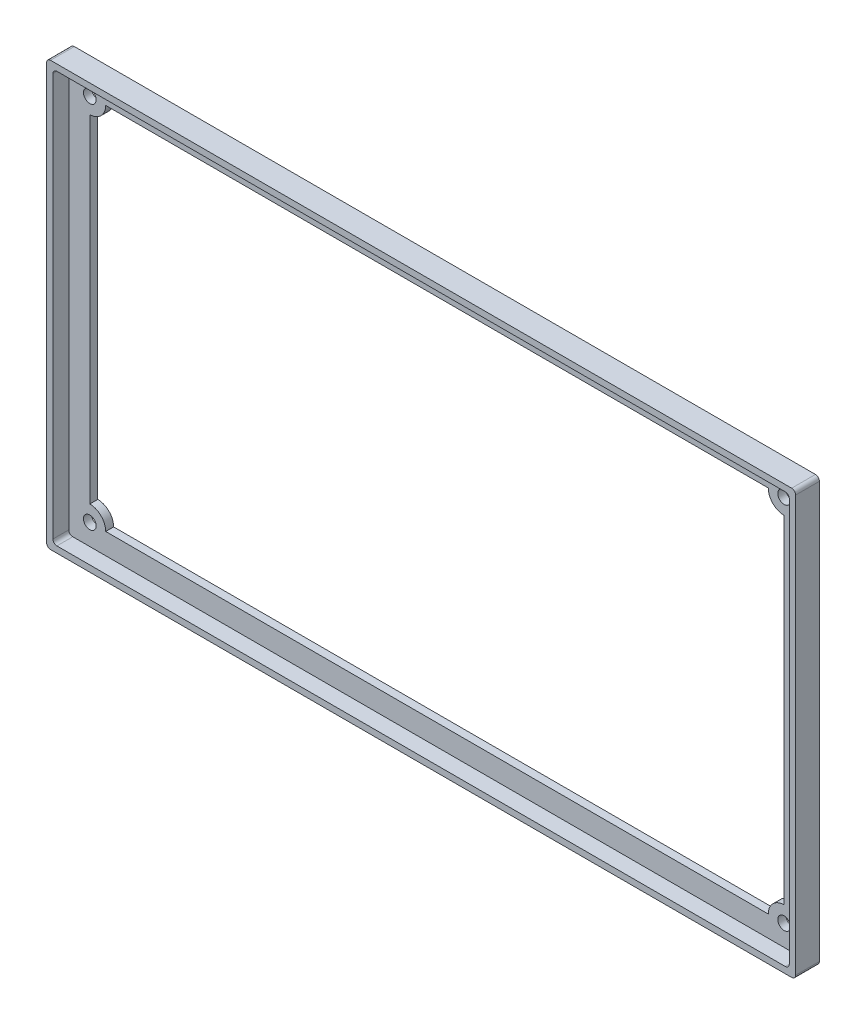
ISO-10303-21;
HEADER;
FILE_DESCRIPTION(('STEP AP214'),'2;1');
FILE_NAME('part.step','',(''),(''),'','','');
FILE_SCHEMA(('AUTOMOTIVE_DESIGN { 1 0 10303 214 1 1 1 1 }'));
ENDSEC;
DATA;
#1=APPLICATION_CONTEXT('core data for automotive mechanical design processes');
#2=APPLICATION_PROTOCOL_DEFINITION('international standard','automotive_design',2000,#1);
#3=PRODUCT_CONTEXT('',#1,'mechanical');
#4=PRODUCT('Part','Part','',(#3));
#5=PRODUCT_RELATED_PRODUCT_CATEGORY('part','',(#4));
#6=PRODUCT_DEFINITION_FORMATION('','',#4);
#7=PRODUCT_DEFINITION_CONTEXT('part definition',#1,'design');
#8=PRODUCT_DEFINITION('design','',#6,#7);
#9=PRODUCT_DEFINITION_SHAPE('','',#8);
#10=(LENGTH_UNIT() NAMED_UNIT(*) SI_UNIT(.MILLI.,.METRE.));
#11=(NAMED_UNIT(*) PLANE_ANGLE_UNIT() SI_UNIT($,.RADIAN.));
#12=(NAMED_UNIT(*) SI_UNIT($,.STERADIAN.) SOLID_ANGLE_UNIT());
#13=UNCERTAINTY_MEASURE_WITH_UNIT(LENGTH_MEASURE(1.E-05),#10,'distance_accuracy_value','');
#14=(GEOMETRIC_REPRESENTATION_CONTEXT(3) GLOBAL_UNCERTAINTY_ASSIGNED_CONTEXT((#13)) GLOBAL_UNIT_ASSIGNED_CONTEXT((#10,
#11,#12)) REPRESENTATION_CONTEXT('',''));
#15=CARTESIAN_POINT('',(0.,0.,0.));
#16=DIRECTION('',(0.,0.,1.));
#17=DIRECTION('',(1.,0.,0.));
#18=AXIS2_PLACEMENT_3D('',#15,#16,#17);
#19=CARTESIAN_POINT('',(0.,99.9,2.));
#20=DIRECTION('',(0.,1.,0.));
#21=DIRECTION('',(0.,0.,1.));
#22=AXIS2_PLACEMENT_3D('',#19,#20,#21);
#23=PLANE('',#22);
#24=DIRECTION('',(1.,0.,0.));
#25=VECTOR('',#24,1.);
#26=CARTESIAN_POINT('',(0.,99.9,0.));
#27=LINE('',#26,#25);
#28=CARTESIAN_POINT('',(10.9,99.9,0.));
#29=VERTEX_POINT('',#28);
#30=CARTESIAN_POINT('',(177.9,99.9,0.));
#31=VERTEX_POINT('',#30);
#32=EDGE_CURVE('E222',#29,#31,#27,.T.);
#33=ORIENTED_EDGE('',*,*,#32,.T.);
#34=DIRECTION('',(0.,0.,-1.));
#35=VECTOR('',#34,1.);
#36=CARTESIAN_POINT('',(177.9,99.9,2.));
#37=LINE('',#36,#35);
#38=CARTESIAN_POINT('',(177.9,99.9,2.));
#39=VERTEX_POINT('',#38);
#40=EDGE_CURVE('E203',#39,#31,#37,.T.);
#41=ORIENTED_EDGE('',*,*,#40,.F.);
#42=DIRECTION('',(1.,0.,0.));
#43=VECTOR('',#42,1.);
#44=CARTESIAN_POINT('',(0.,99.9,2.));
#45=LINE('',#44,#43);
#46=CARTESIAN_POINT('',(10.9,99.9,2.));
#47=VERTEX_POINT('',#46);
#48=EDGE_CURVE('E210',#47,#39,#45,.T.);
#49=ORIENTED_EDGE('',*,*,#48,.F.);
#50=DIRECTION('',(0.,0.,-1.));
#51=VECTOR('',#50,1.);
#52=CARTESIAN_POINT('',(10.9,99.9,2.));
#53=LINE('',#52,#51);
#54=EDGE_CURVE('E342',#47,#29,#53,.T.);
#55=ORIENTED_EDGE('',*,*,#54,.T.);
#56=EDGE_LOOP('',(#33,#41,#49,#55));
#57=FACE_BOUND('',#56,.T.);
#58=ADVANCED_FACE('F37',(#57),#23,.F.);
#59=CARTESIAN_POINT('',(181.9,99.9,2.));
#60=DIRECTION('',(0.,0.,-1.));
#61=DIRECTION('',(-1.,0.,0.));
#62=AXIS2_PLACEMENT_3D('',#59,#60,#61);
#63=CYLINDRICAL_SURFACE('',#62,3.99999999999999);
#64=CARTESIAN_POINT('',(181.9,99.9,0.));
#65=DIRECTION('',(0.,0.,1.));
#66=DIRECTION('',(1.,0.,0.));
#67=AXIS2_PLACEMENT_3D('',#64,#65,#66);
#68=CIRCLE('',#67,3.99999999999999);
#69=CARTESIAN_POINT('',(181.9,95.9,0.));
#70=VERTEX_POINT('',#69);
#71=EDGE_CURVE('E344',#31,#70,#68,.T.);
#72=ORIENTED_EDGE('',*,*,#71,.T.);
#73=DIRECTION('',(0.,0.,-1.));
#74=VECTOR('',#73,1.);
#75=CARTESIAN_POINT('',(181.9,95.9,2.));
#76=LINE('',#75,#74);
#77=CARTESIAN_POINT('',(181.9,95.9,2.));
#78=VERTEX_POINT('',#77);
#79=EDGE_CURVE('E206',#78,#70,#76,.T.);
#80=ORIENTED_EDGE('',*,*,#79,.F.);
#81=CARTESIAN_POINT('',(181.9,99.9,2.));
#82=DIRECTION('',(0.,0.,1.));
#83=DIRECTION('',(1.,0.,0.));
#84=AXIS2_PLACEMENT_3D('',#81,#82,#83);
#85=CIRCLE('',#84,3.99999999999999);
#86=EDGE_CURVE('E199',#39,#78,#85,.T.);
#87=ORIENTED_EDGE('',*,*,#86,.F.);
#88=ORIENTED_EDGE('',*,*,#40,.T.);
#89=EDGE_LOOP('',(#72,#80,#87,#88));
#90=FACE_BOUND('',#89,.T.);
#91=ADVANCED_FACE('F201',(#90),#63,.T.);
#92=CARTESIAN_POINT('',(181.9,0.,2.));
#93=DIRECTION('',(1.,0.,0.));
#94=DIRECTION('',(0.,1.,0.));
#95=AXIS2_PLACEMENT_3D('',#92,#93,#94);
#96=PLANE('',#95);
#97=DIRECTION('',(0.,-1.,0.));
#98=VECTOR('',#97,1.);
#99=CARTESIAN_POINT('',(181.9,0.,0.));
#100=LINE('',#99,#98);
#101=CARTESIAN_POINT('',(181.9,10.9,0.));
#102=VERTEX_POINT('',#101);
#103=EDGE_CURVE('E347',#70,#102,#100,.T.);
#104=ORIENTED_EDGE('',*,*,#103,.T.);
#105=DIRECTION('',(0.,0.,-1.));
#106=VECTOR('',#105,1.);
#107=CARTESIAN_POINT('',(181.9,10.9,2.));
#108=LINE('',#107,#106);
#109=CARTESIAN_POINT('',(181.9,10.9,2.));
#110=VERTEX_POINT('',#109);
#111=EDGE_CURVE('E227',#110,#102,#108,.T.);
#112=ORIENTED_EDGE('',*,*,#111,.F.);
#113=DIRECTION('',(0.,-1.,0.));
#114=VECTOR('',#113,1.);
#115=CARTESIAN_POINT('',(181.9,0.,2.));
#116=LINE('',#115,#114);
#117=EDGE_CURVE('E209',#78,#110,#116,.T.);
#118=ORIENTED_EDGE('',*,*,#117,.F.);
#119=ORIENTED_EDGE('',*,*,#79,.T.);
#120=EDGE_LOOP('',(#104,#112,#118,#119));
#121=FACE_BOUND('',#120,.T.);
#122=ADVANCED_FACE('F472',(#121),#96,.F.);
#123=CARTESIAN_POINT('',(181.9,6.9,2.));
#124=DIRECTION('',(0.,0.,-1.));
#125=DIRECTION('',(-1.,0.,0.));
#126=AXIS2_PLACEMENT_3D('',#123,#124,#125);
#127=CYLINDRICAL_SURFACE('',#126,3.99999999999999);
#128=CARTESIAN_POINT('',(181.9,6.9,0.));
#129=DIRECTION('',(0.,0.,1.));
#130=DIRECTION('',(1.,0.,0.));
#131=AXIS2_PLACEMENT_3D('',#128,#129,#130);
#132=CIRCLE('',#131,3.99999999999999);
#133=CARTESIAN_POINT('',(177.9,6.9,0.));
#134=VERTEX_POINT('',#133);
#135=EDGE_CURVE('E349',#102,#134,#132,.T.);
#136=ORIENTED_EDGE('',*,*,#135,.T.);
#137=DIRECTION('',(0.,0.,-1.));
#138=VECTOR('',#137,1.);
#139=CARTESIAN_POINT('',(177.9,6.9,2.));
#140=LINE('',#139,#138);
#141=CARTESIAN_POINT('',(177.9,6.9,2.));
#142=VERTEX_POINT('',#141);
#143=EDGE_CURVE('E380',#142,#134,#140,.T.);
#144=ORIENTED_EDGE('',*,*,#143,.F.);
#145=CARTESIAN_POINT('',(181.9,6.9,2.));
#146=DIRECTION('',(0.,0.,1.));
#147=DIRECTION('',(1.,0.,0.));
#148=AXIS2_PLACEMENT_3D('',#145,#146,#147);
#149=CIRCLE('',#148,3.99999999999999);
#150=EDGE_CURVE('E389',#110,#142,#149,.T.);
#151=ORIENTED_EDGE('',*,*,#150,.F.);
#152=ORIENTED_EDGE('',*,*,#111,.T.);
#153=EDGE_LOOP('',(#136,#144,#151,#152));
#154=FACE_BOUND('',#153,.T.);
#155=ADVANCED_FACE('F387',(#154),#127,.T.);
#156=CARTESIAN_POINT('',(0.,6.9,2.));
#157=DIRECTION('',(0.,-1.,0.));
#158=DIRECTION('',(0.,0.,-1.));
#159=AXIS2_PLACEMENT_3D('',#156,#157,#158);
#160=PLANE('',#159);
#161=DIRECTION('',(-1.,0.,0.));
#162=VECTOR('',#161,1.);
#163=CARTESIAN_POINT('',(0.,6.9,0.));
#164=LINE('',#163,#162);
#165=CARTESIAN_POINT('',(10.9,6.9,0.));
#166=VERTEX_POINT('',#165);
#167=EDGE_CURVE('E351',#134,#166,#164,.T.);
#168=ORIENTED_EDGE('',*,*,#167,.T.);
#169=DIRECTION('',(0.,0.,-1.));
#170=VECTOR('',#169,1.);
#171=CARTESIAN_POINT('',(10.9,6.9,2.));
#172=LINE('',#171,#170);
#173=CARTESIAN_POINT('',(10.9,6.9,2.));
#174=VERTEX_POINT('',#173);
#175=EDGE_CURVE('E377',#174,#166,#172,.T.);
#176=ORIENTED_EDGE('',*,*,#175,.F.);
#177=DIRECTION('',(-1.,0.,0.));
#178=VECTOR('',#177,1.);
#179=CARTESIAN_POINT('',(0.,6.9,2.));
#180=LINE('',#179,#178);
#181=EDGE_CURVE('E409',#142,#174,#180,.T.);
#182=ORIENTED_EDGE('',*,*,#181,.F.);
#183=ORIENTED_EDGE('',*,*,#143,.T.);
#184=EDGE_LOOP('',(#168,#176,#182,#183));
#185=FACE_BOUND('',#184,.T.);
#186=ADVANCED_FACE('F400',(#185),#160,.F.);
#187=CARTESIAN_POINT('',(6.89999999999998,6.9,2.));
#188=DIRECTION('',(0.,0.,-1.));
#189=DIRECTION('',(-1.,0.,0.));
#190=AXIS2_PLACEMENT_3D('',#187,#188,#189);
#191=CYLINDRICAL_SURFACE('',#190,4.);
#192=CARTESIAN_POINT('',(6.89999999999998,6.9,0.));
#193=DIRECTION('',(0.,0.,1.));
#194=DIRECTION('',(1.,0.,0.));
#195=AXIS2_PLACEMENT_3D('',#192,#193,#194);
#196=CIRCLE('',#195,4.);
#197=CARTESIAN_POINT('',(6.89999999999998,10.9,0.));
#198=VERTEX_POINT('',#197);
#199=EDGE_CURVE('E353',#166,#198,#196,.T.);
#200=ORIENTED_EDGE('',*,*,#199,.T.);
#201=DIRECTION('',(0.,0.,-1.));
#202=VECTOR('',#201,1.);
#203=CARTESIAN_POINT('',(6.89999999999998,10.9,2.));
#204=LINE('',#203,#202);
#205=CARTESIAN_POINT('',(6.89999999999998,10.9,2.));
#206=VERTEX_POINT('',#205);
#207=EDGE_CURVE('E374',#206,#198,#204,.T.);
#208=ORIENTED_EDGE('',*,*,#207,.F.);
#209=CARTESIAN_POINT('',(6.89999999999998,6.9,2.));
#210=DIRECTION('',(0.,0.,1.));
#211=DIRECTION('',(1.,0.,0.));
#212=AXIS2_PLACEMENT_3D('',#209,#210,#211);
#213=CIRCLE('',#212,4.);
#214=EDGE_CURVE('E406',#174,#206,#213,.T.);
#215=ORIENTED_EDGE('',*,*,#214,.F.);
#216=ORIENTED_EDGE('',*,*,#175,.T.);
#217=EDGE_LOOP('',(#200,#208,#215,#216));
#218=FACE_BOUND('',#217,.T.);
#219=ADVANCED_FACE('F404',(#218),#191,.T.);
#220=CARTESIAN_POINT('',(6.89999999999998,0.,2.));
#221=DIRECTION('',(-1.,0.,0.));
#222=DIRECTION('',(0.,0.,1.));
#223=AXIS2_PLACEMENT_3D('',#220,#221,#222);
#224=PLANE('',#223);
#225=DIRECTION('',(0.,1.,0.));
#226=VECTOR('',#225,1.);
#227=CARTESIAN_POINT('',(6.89999999999998,0.,0.));
#228=LINE('',#227,#226);
#229=CARTESIAN_POINT('',(6.89999999999998,95.9,0.));
#230=VERTEX_POINT('',#229);
#231=EDGE_CURVE('E355',#198,#230,#228,.T.);
#232=ORIENTED_EDGE('',*,*,#231,.T.);
#233=DIRECTION('',(0.,0.,-1.));
#234=VECTOR('',#233,1.);
#235=CARTESIAN_POINT('',(6.89999999999998,95.9,2.));
#236=LINE('',#235,#234);
#237=CARTESIAN_POINT('',(6.89999999999998,95.9,2.));
#238=VERTEX_POINT('',#237);
#239=EDGE_CURVE('E371',#238,#230,#236,.T.);
#240=ORIENTED_EDGE('',*,*,#239,.F.);
#241=DIRECTION('',(0.,1.,0.));
#242=VECTOR('',#241,1.);
#243=CARTESIAN_POINT('',(6.89999999999998,0.,2.));
#244=LINE('',#243,#242);
#245=EDGE_CURVE('E408',#206,#238,#244,.T.);
#246=ORIENTED_EDGE('',*,*,#245,.F.);
#247=ORIENTED_EDGE('',*,*,#207,.T.);
#248=EDGE_LOOP('',(#232,#240,#246,#247));
#249=FACE_BOUND('',#248,.T.);
#250=ADVANCED_FACE('F540',(#249),#224,.F.);
#251=CARTESIAN_POINT('',(181.9,6.9,2.));
#252=DIRECTION('',(0.,0.,-1.));
#253=DIRECTION('',(-1.,0.,0.));
#254=AXIS2_PLACEMENT_3D('',#251,#252,#253);
#255=CYLINDRICAL_SURFACE('',#254,1.59999999999999);
#256=CARTESIAN_POINT('',(181.9,6.9,2.));
#257=DIRECTION('',(0.,0.,1.));
#258=DIRECTION('',(1.,0.,0.));
#259=AXIS2_PLACEMENT_3D('',#256,#257,#258);
#260=CIRCLE('',#259,1.59999999999999);
#261=CARTESIAN_POINT('',(183.5,6.9,2.));
#262=VERTEX_POINT('',#261);
#263=EDGE_CURVE('E336',#262,#262,#260,.T.);
#264=ORIENTED_EDGE('',*,*,#263,.T.);
#265=EDGE_LOOP('',(#264));
#266=FACE_BOUND('',#265,.T.);
#267=CARTESIAN_POINT('',(181.9,6.9,0.));
#268=DIRECTION('',(0.,0.,1.));
#269=DIRECTION('',(1.,0.,0.));
#270=AXIS2_PLACEMENT_3D('',#267,#268,#269);
#271=CIRCLE('',#270,1.59999999999999);
#272=CARTESIAN_POINT('',(183.5,6.9,0.));
#273=VERTEX_POINT('',#272);
#274=EDGE_CURVE('E365',#273,#273,#271,.T.);
#275=ORIENTED_EDGE('',*,*,#274,.F.);
#276=EDGE_LOOP('',(#275));
#277=FACE_BOUND('',#276,.T.);
#278=ADVANCED_FACE('F536',(#266,#277),#255,.F.);
#279=CARTESIAN_POINT('',(6.89999999999998,6.9,2.));
#280=DIRECTION('',(0.,0.,-1.));
#281=DIRECTION('',(-1.,0.,0.));
#282=AXIS2_PLACEMENT_3D('',#279,#280,#281);
#283=CYLINDRICAL_SURFACE('',#282,1.6);
#284=CARTESIAN_POINT('',(6.89999999999998,6.9,2.));
#285=DIRECTION('',(0.,0.,1.));
#286=DIRECTION('',(1.,0.,0.));
#287=AXIS2_PLACEMENT_3D('',#284,#285,#286);
#288=CIRCLE('',#287,1.6);
#289=CARTESIAN_POINT('',(8.49999999999998,6.9,2.));
#290=VERTEX_POINT('',#289);
#291=EDGE_CURVE('E333',#290,#290,#288,.T.);
#292=ORIENTED_EDGE('',*,*,#291,.T.);
#293=EDGE_LOOP('',(#292));
#294=FACE_BOUND('',#293,.T.);
#295=CARTESIAN_POINT('',(6.89999999999998,6.9,0.));
#296=DIRECTION('',(0.,0.,1.));
#297=DIRECTION('',(1.,0.,0.));
#298=AXIS2_PLACEMENT_3D('',#295,#296,#297);
#299=CIRCLE('',#298,1.6);
#300=CARTESIAN_POINT('',(8.49999999999998,6.9,0.));
#301=VERTEX_POINT('',#300);
#302=EDGE_CURVE('E362',#301,#301,#299,.T.);
#303=ORIENTED_EDGE('',*,*,#302,.F.);
#304=EDGE_LOOP('',(#303));
#305=FACE_BOUND('',#304,.T.);
#306=ADVANCED_FACE('F539',(#294,#305),#283,.F.);
#307=CARTESIAN_POINT('',(6.89999999999998,99.9,2.));
#308=DIRECTION('',(0.,0.,-1.));
#309=DIRECTION('',(-1.,0.,0.));
#310=AXIS2_PLACEMENT_3D('',#307,#308,#309);
#311=CYLINDRICAL_SURFACE('',#310,1.6);
#312=CARTESIAN_POINT('',(6.89999999999998,99.9,2.));
#313=DIRECTION('',(0.,0.,1.));
#314=DIRECTION('',(1.,0.,0.));
#315=AXIS2_PLACEMENT_3D('',#312,#313,#314);
#316=CIRCLE('',#315,1.6);
#317=CARTESIAN_POINT('',(8.49999999999999,99.9,2.));
#318=VERTEX_POINT('',#317);
#319=EDGE_CURVE('E330',#318,#318,#316,.T.);
#320=ORIENTED_EDGE('',*,*,#319,.T.);
#321=EDGE_LOOP('',(#320));
#322=FACE_BOUND('',#321,.T.);
#323=CARTESIAN_POINT('',(6.89999999999998,99.9,0.));
#324=DIRECTION('',(0.,0.,1.));
#325=DIRECTION('',(1.,0.,0.));
#326=AXIS2_PLACEMENT_3D('',#323,#324,#325);
#327=CIRCLE('',#326,1.6);
#328=CARTESIAN_POINT('',(8.49999999999999,99.9,0.));
#329=VERTEX_POINT('',#328);
#330=EDGE_CURVE('E359',#329,#329,#327,.T.);
#331=ORIENTED_EDGE('',*,*,#330,.F.);
#332=EDGE_LOOP('',(#331));
#333=FACE_BOUND('',#332,.T.);
#334=ADVANCED_FACE('F544',(#322,#333),#311,.F.);
#335=CARTESIAN_POINT('',(6.89999999999998,99.9,2.));
#336=DIRECTION('',(0.,0.,-1.));
#337=DIRECTION('',(-1.,0.,0.));
#338=AXIS2_PLACEMENT_3D('',#335,#336,#337);
#339=CYLINDRICAL_SURFACE('',#338,4.);
#340=CARTESIAN_POINT('',(6.89999999999998,99.9,0.));
#341=DIRECTION('',(0.,0.,1.));
#342=DIRECTION('',(1.,0.,0.));
#343=AXIS2_PLACEMENT_3D('',#340,#341,#342);
#344=CIRCLE('',#343,4.);
#345=EDGE_CURVE('E357',#230,#29,#344,.T.);
#346=ORIENTED_EDGE('',*,*,#345,.T.);
#347=ORIENTED_EDGE('',*,*,#54,.F.);
#348=CARTESIAN_POINT('',(6.89999999999998,99.9,2.));
#349=DIRECTION('',(0.,0.,1.));
#350=DIRECTION('',(1.,0.,0.));
#351=AXIS2_PLACEMENT_3D('',#348,#349,#350);
#352=CIRCLE('',#351,4.);
#353=EDGE_CURVE('E215',#238,#47,#352,.T.);
#354=ORIENTED_EDGE('',*,*,#353,.F.);
#355=ORIENTED_EDGE('',*,*,#239,.T.);
#356=EDGE_LOOP('',(#346,#347,#354,#355));
#357=FACE_BOUND('',#356,.T.);
#358=ADVANCED_FACE('F534',(#357),#339,.T.);
#359=CARTESIAN_POINT('',(181.9,99.9,2.));
#360=DIRECTION('',(0.,0.,-1.));
#361=DIRECTION('',(-1.,0.,0.));
#362=AXIS2_PLACEMENT_3D('',#359,#360,#361);
#363=CYLINDRICAL_SURFACE('',#362,1.59999999999999);
#364=CARTESIAN_POINT('',(181.9,99.9,2.));
#365=DIRECTION('',(0.,0.,1.));
#366=DIRECTION('',(1.,0.,0.));
#367=AXIS2_PLACEMENT_3D('',#364,#365,#366);
#368=CIRCLE('',#367,1.59999999999999);
#369=CARTESIAN_POINT('',(183.5,99.9,2.));
#370=VERTEX_POINT('',#369);
#371=EDGE_CURVE('E339',#370,#370,#368,.T.);
#372=ORIENTED_EDGE('',*,*,#371,.T.);
#373=EDGE_LOOP('',(#372));
#374=FACE_BOUND('',#373,.T.);
#375=CARTESIAN_POINT('',(181.9,99.9,0.));
#376=DIRECTION('',(0.,0.,1.));
#377=DIRECTION('',(1.,0.,0.));
#378=AXIS2_PLACEMENT_3D('',#375,#376,#377);
#379=CIRCLE('',#378,1.59999999999999);
#380=CARTESIAN_POINT('',(183.5,99.9,0.));
#381=VERTEX_POINT('',#380);
#382=EDGE_CURVE('E219',#381,#381,#379,.T.);
#383=ORIENTED_EDGE('',*,*,#382,.F.);
#384=EDGE_LOOP('',(#383));
#385=FACE_BOUND('',#384,.T.);
#386=ADVANCED_FACE('F528',(#374,#385),#363,.F.);
#387=CARTESIAN_POINT('',(0.,0.,2.));
#388=DIRECTION('',(0.,0.,1.));
#389=DIRECTION('',(1.,0.,0.));
#390=AXIS2_PLACEMENT_3D('',#387,#388,#389);
#391=PLANE('',#390);
#392=ORIENTED_EDGE('',*,*,#48,.T.);
#393=ORIENTED_EDGE('',*,*,#86,.T.);
#394=ORIENTED_EDGE('',*,*,#117,.T.);
#395=ORIENTED_EDGE('',*,*,#150,.T.);
#396=ORIENTED_EDGE('',*,*,#181,.T.);
#397=ORIENTED_EDGE('',*,*,#214,.T.);
#398=ORIENTED_EDGE('',*,*,#245,.T.);
#399=ORIENTED_EDGE('',*,*,#353,.T.);
#400=EDGE_LOOP('',(#392,#393,#394,#395,#396,#397,#398,#399));
#401=FACE_BOUND('',#400,.T.);
#402=DIRECTION('',(1.,0.,0.));
#403=VECTOR('',#402,1.);
#404=CARTESIAN_POINT('',(0.,105.2,2.));
#405=LINE('',#404,#403);
#406=CARTESIAN_POINT('',(2.59999999999997,105.2,2.));
#407=VERTEX_POINT('',#406);
#408=CARTESIAN_POINT('',(186.2,105.2,2.));
#409=VERTEX_POINT('',#408);
#410=EDGE_CURVE('E321',#407,#409,#405,.T.);
#411=ORIENTED_EDGE('',*,*,#410,.F.);
#412=CARTESIAN_POINT('',(2.59999999999997,104.2,2.));
#413=DIRECTION('',(0.,0.,1.));
#414=DIRECTION('',(1.,0.,0.));
#415=AXIS2_PLACEMENT_3D('',#412,#413,#414);
#416=CIRCLE('',#415,1.);
#417=CARTESIAN_POINT('',(1.59999999999997,104.2,2.));
#418=VERTEX_POINT('',#417);
#419=EDGE_CURVE('E52',#407,#418,#416,.T.);
#420=ORIENTED_EDGE('',*,*,#419,.T.);
#421=DIRECTION('',(0.,1.,0.));
#422=VECTOR('',#421,1.);
#423=CARTESIAN_POINT('',(1.6,0.,2.));
#424=LINE('',#423,#422);
#425=CARTESIAN_POINT('',(1.6,2.6,2.));
#426=VERTEX_POINT('',#425);
#427=EDGE_CURVE('E324',#426,#418,#424,.T.);
#428=ORIENTED_EDGE('',*,*,#427,.F.);
#429=CARTESIAN_POINT('',(2.6,2.6,2.));
#430=DIRECTION('',(0.,0.,1.));
#431=DIRECTION('',(1.,0.,0.));
#432=AXIS2_PLACEMENT_3D('',#429,#430,#431);
#433=CIRCLE('',#432,1.);
#434=CARTESIAN_POINT('',(2.6,1.6,2.));
#435=VERTEX_POINT('',#434);
#436=EDGE_CURVE('E60',#426,#435,#433,.T.);
#437=ORIENTED_EDGE('',*,*,#436,.T.);
#438=DIRECTION('',(1.,0.,0.));
#439=VECTOR('',#438,1.);
#440=CARTESIAN_POINT('',(0.,1.6,2.));
#441=LINE('',#440,#439);
#442=CARTESIAN_POINT('',(186.2,1.6,2.));
#443=VERTEX_POINT('',#442);
#444=EDGE_CURVE('E317',#435,#443,#441,.T.);
#445=ORIENTED_EDGE('',*,*,#444,.T.);
#446=CARTESIAN_POINT('',(186.2,2.6,2.));
#447=DIRECTION('',(0.,0.,1.));
#448=DIRECTION('',(1.,0.,0.));
#449=AXIS2_PLACEMENT_3D('',#446,#447,#448);
#450=CIRCLE('',#449,1.);
#451=CARTESIAN_POINT('',(187.2,2.6,2.));
#452=VERTEX_POINT('',#451);
#453=EDGE_CURVE('E271',#443,#452,#450,.T.);
#454=ORIENTED_EDGE('',*,*,#453,.T.);
#455=DIRECTION('',(0.,1.,0.));
#456=VECTOR('',#455,1.);
#457=CARTESIAN_POINT('',(187.2,0.,2.));
#458=LINE('',#457,#456);
#459=CARTESIAN_POINT('',(187.2,104.2,2.));
#460=VERTEX_POINT('',#459);
#461=EDGE_CURVE('E316',#452,#460,#458,.T.);
#462=ORIENTED_EDGE('',*,*,#461,.T.);
#463=CARTESIAN_POINT('',(186.2,104.2,2.));
#464=DIRECTION('',(0.,0.,1.));
#465=DIRECTION('',(1.,0.,0.));
#466=AXIS2_PLACEMENT_3D('',#463,#464,#465);
#467=CIRCLE('',#466,1.);
#468=EDGE_CURVE('E269',#460,#409,#467,.T.);
#469=ORIENTED_EDGE('',*,*,#468,.T.);
#470=EDGE_LOOP('',(#411,#420,#428,#437,#445,#454,#462,#469));
#471=FACE_BOUND('',#470,.T.);
#472=ORIENTED_EDGE('',*,*,#319,.F.);
#473=EDGE_LOOP('',(#472));
#474=FACE_BOUND('',#473,.T.);
#475=ORIENTED_EDGE('',*,*,#291,.F.);
#476=EDGE_LOOP('',(#475));
#477=FACE_BOUND('',#476,.T.);
#478=ORIENTED_EDGE('',*,*,#263,.F.);
#479=EDGE_LOOP('',(#478));
#480=FACE_BOUND('',#479,.T.);
#481=ORIENTED_EDGE('',*,*,#371,.F.);
#482=EDGE_LOOP('',(#481));
#483=FACE_BOUND('',#482,.T.);
#484=ADVANCED_FACE('F213',(#401,#471,#474,#477,#480,#483),#391,.T.);
#485=CARTESIAN_POINT('',(0.,0.,0.));
#486=DIRECTION('',(0.,0.,1.));
#487=DIRECTION('',(1.,0.,0.));
#488=AXIS2_PLACEMENT_3D('',#485,#486,#487);
#489=PLANE('',#488);
#490=ORIENTED_EDGE('',*,*,#32,.F.);
#491=ORIENTED_EDGE('',*,*,#345,.F.);
#492=ORIENTED_EDGE('',*,*,#231,.F.);
#493=ORIENTED_EDGE('',*,*,#199,.F.);
#494=ORIENTED_EDGE('',*,*,#167,.F.);
#495=ORIENTED_EDGE('',*,*,#135,.F.);
#496=ORIENTED_EDGE('',*,*,#103,.F.);
#497=ORIENTED_EDGE('',*,*,#71,.F.);
#498=EDGE_LOOP('',(#490,#491,#492,#493,#494,#495,#496,#497));
#499=FACE_BOUND('',#498,.T.);
#500=ORIENTED_EDGE('',*,*,#330,.T.);
#501=EDGE_LOOP('',(#500));
#502=FACE_BOUND('',#501,.T.);
#503=ORIENTED_EDGE('',*,*,#302,.T.);
#504=EDGE_LOOP('',(#503));
#505=FACE_BOUND('',#504,.T.);
#506=ORIENTED_EDGE('',*,*,#274,.T.);
#507=EDGE_LOOP('',(#506));
#508=FACE_BOUND('',#507,.T.);
#509=ORIENTED_EDGE('',*,*,#382,.T.);
#510=EDGE_LOOP('',(#509));
#511=FACE_BOUND('',#510,.T.);
#512=DIRECTION('',(1.,0.,0.));
#513=VECTOR('',#512,1.);
#514=CARTESIAN_POINT('',(0.,0.,0.));
#515=LINE('',#514,#513);
#516=CARTESIAN_POINT('',(1.,0.,0.));
#517=VERTEX_POINT('',#516);
#518=CARTESIAN_POINT('',(187.8,0.,0.));
#519=VERTEX_POINT('',#518);
#520=EDGE_CURVE('E425',#517,#519,#515,.T.);
#521=ORIENTED_EDGE('',*,*,#520,.F.);
#522=CARTESIAN_POINT('',(1.,1.,0.));
#523=DIRECTION('',(0.,0.,1.));
#524=DIRECTION('',(1.,0.,0.));
#525=AXIS2_PLACEMENT_3D('',#522,#523,#524);
#526=CIRCLE('',#525,1.);
#527=CARTESIAN_POINT('',(0.,1.,0.));
#528=VERTEX_POINT('',#527);
#529=EDGE_CURVE('E239',#517,#528,#526,.F.);
#530=ORIENTED_EDGE('',*,*,#529,.T.);
#531=DIRECTION('',(0.,1.,0.));
#532=VECTOR('',#531,1.);
#533=CARTESIAN_POINT('',(0.,0.,0.));
#534=LINE('',#533,#532);
#535=CARTESIAN_POINT('',(0.,105.8,0.));
#536=VERTEX_POINT('',#535);
#537=EDGE_CURVE('E416',#528,#536,#534,.T.);
#538=ORIENTED_EDGE('',*,*,#537,.T.);
#539=CARTESIAN_POINT('',(1.,105.8,0.));
#540=DIRECTION('',(0.,0.,1.));
#541=DIRECTION('',(1.,0.,0.));
#542=AXIS2_PLACEMENT_3D('',#539,#540,#541);
#543=CIRCLE('',#542,1.);
#544=CARTESIAN_POINT('',(1.,106.8,0.));
#545=VERTEX_POINT('',#544);
#546=EDGE_CURVE('E233',#536,#545,#543,.F.);
#547=ORIENTED_EDGE('',*,*,#546,.T.);
#548=DIRECTION('',(1.,0.,0.));
#549=VECTOR('',#548,1.);
#550=CARTESIAN_POINT('',(0.,106.8,0.));
#551=LINE('',#550,#549);
#552=CARTESIAN_POINT('',(187.8,106.8,0.));
#553=VERTEX_POINT('',#552);
#554=EDGE_CURVE('E419',#545,#553,#551,.T.);
#555=ORIENTED_EDGE('',*,*,#554,.T.);
#556=CARTESIAN_POINT('',(187.8,105.8,0.));
#557=DIRECTION('',(0.,0.,1.));
#558=DIRECTION('',(1.,0.,0.));
#559=AXIS2_PLACEMENT_3D('',#556,#557,#558);
#560=CIRCLE('',#559,1.);
#561=CARTESIAN_POINT('',(188.8,105.8,0.));
#562=VERTEX_POINT('',#561);
#563=EDGE_CURVE('E235',#553,#562,#560,.F.);
#564=ORIENTED_EDGE('',*,*,#563,.T.);
#565=DIRECTION('',(0.,1.,0.));
#566=VECTOR('',#565,1.);
#567=CARTESIAN_POINT('',(188.8,0.,0.));
#568=LINE('',#567,#566);
#569=CARTESIAN_POINT('',(188.8,1.,0.));
#570=VERTEX_POINT('',#569);
#571=EDGE_CURVE('E422',#570,#562,#568,.T.);
#572=ORIENTED_EDGE('',*,*,#571,.F.);
#573=CARTESIAN_POINT('',(187.8,1.,0.));
#574=DIRECTION('',(0.,0.,1.));
#575=DIRECTION('',(1.,0.,0.));
#576=AXIS2_PLACEMENT_3D('',#573,#574,#575);
#577=CIRCLE('',#576,1.);
#578=EDGE_CURVE('E237',#570,#519,#577,.F.);
#579=ORIENTED_EDGE('',*,*,#578,.T.);
#580=EDGE_LOOP('',(#521,#530,#538,#547,#555,#564,#572,#579));
#581=FACE_BOUND('',#580,.T.);
#582=ADVANCED_FACE('F394',(#499,#502,#505,#508,#511,#581),#489,.F.);
#583=CARTESIAN_POINT('',(0.,0.,6.));
#584=DIRECTION('',(0.,1.,0.));
#585=DIRECTION('',(0.,0.,1.));
#586=AXIS2_PLACEMENT_3D('',#583,#584,#585);
#587=PLANE('',#586);
#588=DIRECTION('',(1.,0.,0.));
#589=VECTOR('',#588,1.);
#590=CARTESIAN_POINT('',(0.,0.,6.));
#591=LINE('',#590,#589);
#592=CARTESIAN_POINT('',(1.,0.,6.));
#593=VERTEX_POINT('',#592);
#594=CARTESIAN_POINT('',(187.8,0.,6.));
#595=VERTEX_POINT('',#594);
#596=EDGE_CURVE('E436',#593,#595,#591,.T.);
#597=ORIENTED_EDGE('',*,*,#596,.F.);
#598=DIRECTION('',(0.,0.,-1.));
#599=VECTOR('',#598,1.);
#600=CARTESIAN_POINT('',(1.,0.,0.));
#601=LINE('',#600,#599);
#602=EDGE_CURVE('E225',#593,#517,#601,.T.);
#603=ORIENTED_EDGE('',*,*,#602,.T.);
#604=ORIENTED_EDGE('',*,*,#520,.T.);
#605=DIRECTION('',(0.,0.,-1.));
#606=VECTOR('',#605,1.);
#607=CARTESIAN_POINT('',(187.8,0.,6.));
#608=LINE('',#607,#606);
#609=EDGE_CURVE('E223',#519,#595,#608,.F.);
#610=ORIENTED_EDGE('',*,*,#609,.T.);
#611=EDGE_LOOP('',(#597,#603,#604,#610));
#612=FACE_BOUND('',#611,.T.);
#613=ADVANCED_FACE('F506',(#612),#587,.F.);
#614=CARTESIAN_POINT('',(188.8,0.,6.));
#615=DIRECTION('',(-1.,0.,0.));
#616=DIRECTION('',(0.,0.,1.));
#617=AXIS2_PLACEMENT_3D('',#614,#615,#616);
#618=PLANE('',#617);
#619=DIRECTION('',(0.,1.,0.));
#620=VECTOR('',#619,1.);
#621=CARTESIAN_POINT('',(188.8,0.,6.));
#622=LINE('',#621,#620);
#623=CARTESIAN_POINT('',(188.8,1.,6.));
#624=VERTEX_POINT('',#623);
#625=CARTESIAN_POINT('',(188.8,105.8,6.));
#626=VERTEX_POINT('',#625);
#627=EDGE_CURVE('E433',#624,#626,#622,.T.);
#628=ORIENTED_EDGE('',*,*,#627,.F.);
#629=DIRECTION('',(0.,0.,-1.));
#630=VECTOR('',#629,1.);
#631=CARTESIAN_POINT('',(188.8,1.,6.));
#632=LINE('',#631,#630);
#633=EDGE_CURVE('E256',#624,#570,#632,.T.);
#634=ORIENTED_EDGE('',*,*,#633,.T.);
#635=ORIENTED_EDGE('',*,*,#571,.T.);
#636=DIRECTION('',(0.,0.,-1.));
#637=VECTOR('',#636,1.);
#638=CARTESIAN_POINT('',(188.8,105.8,6.));
#639=LINE('',#638,#637);
#640=EDGE_CURVE('E254',#562,#626,#639,.F.);
#641=ORIENTED_EDGE('',*,*,#640,.T.);
#642=EDGE_LOOP('',(#628,#634,#635,#641));
#643=FACE_BOUND('',#642,.T.);
#644=ADVANCED_FACE('F513',(#643),#618,.F.);
#645=CARTESIAN_POINT('',(0.,106.8,6.));
#646=DIRECTION('',(0.,1.,0.));
#647=DIRECTION('',(0.,0.,1.));
#648=AXIS2_PLACEMENT_3D('',#645,#646,#647);
#649=PLANE('',#648);
#650=DIRECTION('',(1.,0.,0.));
#651=VECTOR('',#650,1.);
#652=CARTESIAN_POINT('',(0.,106.8,6.));
#653=LINE('',#652,#651);
#654=CARTESIAN_POINT('',(1.,106.8,6.));
#655=VERTEX_POINT('',#654);
#656=CARTESIAN_POINT('',(187.8,106.8,6.));
#657=VERTEX_POINT('',#656);
#658=EDGE_CURVE('E430',#655,#657,#653,.T.);
#659=ORIENTED_EDGE('',*,*,#658,.T.);
#660=DIRECTION('',(0.,0.,-1.));
#661=VECTOR('',#660,1.);
#662=CARTESIAN_POINT('',(187.8,106.8,0.));
#663=LINE('',#662,#661);
#664=EDGE_CURVE('E261',#657,#553,#663,.T.);
#665=ORIENTED_EDGE('',*,*,#664,.T.);
#666=ORIENTED_EDGE('',*,*,#554,.F.);
#667=DIRECTION('',(0.,0.,-1.));
#668=VECTOR('',#667,1.);
#669=CARTESIAN_POINT('',(1.,106.8,6.));
#670=LINE('',#669,#668);
#671=EDGE_CURVE('E259',#545,#655,#670,.F.);
#672=ORIENTED_EDGE('',*,*,#671,.T.);
#673=EDGE_LOOP('',(#659,#665,#666,#672));
#674=FACE_BOUND('',#673,.T.);
#675=ADVANCED_FACE('F518',(#674),#649,.T.);
#676=CARTESIAN_POINT('',(187.2,0.,6.));
#677=DIRECTION('',(-1.,0.,0.));
#678=DIRECTION('',(0.,0.,1.));
#679=AXIS2_PLACEMENT_3D('',#676,#677,#678);
#680=PLANE('',#679);
#681=ORIENTED_EDGE('',*,*,#461,.F.);
#682=DIRECTION('',(0.,0.,-1.));
#683=VECTOR('',#682,1.);
#684=CARTESIAN_POINT('',(187.2,2.6,6.));
#685=LINE('',#684,#683);
#686=CARTESIAN_POINT('',(187.2,2.6,6.));
#687=VERTEX_POINT('',#686);
#688=EDGE_CURVE('E287',#452,#687,#685,.F.);
#689=ORIENTED_EDGE('',*,*,#688,.T.);
#690=DIRECTION('',(0.,1.,0.));
#691=VECTOR('',#690,1.);
#692=CARTESIAN_POINT('',(187.2,0.,6.));
#693=LINE('',#692,#691);
#694=CARTESIAN_POINT('',(187.2,104.2,6.));
#695=VERTEX_POINT('',#694);
#696=EDGE_CURVE('E302',#687,#695,#693,.T.);
#697=ORIENTED_EDGE('',*,*,#696,.T.);
#698=DIRECTION('',(0.,0.,-1.));
#699=VECTOR('',#698,1.);
#700=CARTESIAN_POINT('',(187.2,104.2,6.));
#701=LINE('',#700,#699);
#702=EDGE_CURVE('E284',#695,#460,#701,.T.);
#703=ORIENTED_EDGE('',*,*,#702,.T.);
#704=EDGE_LOOP('',(#681,#689,#697,#703));
#705=FACE_BOUND('',#704,.T.);
#706=ADVANCED_FACE('F319',(#705),#680,.T.);
#707=CARTESIAN_POINT('',(0.,1.6,6.));
#708=DIRECTION('',(0.,1.,0.));
#709=DIRECTION('',(0.,0.,1.));
#710=AXIS2_PLACEMENT_3D('',#707,#708,#709);
#711=PLANE('',#710);
#712=ORIENTED_EDGE('',*,*,#444,.F.);
#713=DIRECTION('',(0.,0.,-1.));
#714=VECTOR('',#713,1.);
#715=CARTESIAN_POINT('',(2.6,1.6,6.));
#716=LINE('',#715,#714);
#717=CARTESIAN_POINT('',(2.6,1.6,6.));
#718=VERTEX_POINT('',#717);
#719=EDGE_CURVE('E282',#435,#718,#716,.F.);
#720=ORIENTED_EDGE('',*,*,#719,.T.);
#721=DIRECTION('',(1.,0.,0.));
#722=VECTOR('',#721,1.);
#723=CARTESIAN_POINT('',(0.,1.6,6.));
#724=LINE('',#723,#722);
#725=CARTESIAN_POINT('',(186.2,1.6,6.));
#726=VERTEX_POINT('',#725);
#727=EDGE_CURVE('E299',#718,#726,#724,.T.);
#728=ORIENTED_EDGE('',*,*,#727,.T.);
#729=DIRECTION('',(0.,0.,-1.));
#730=VECTOR('',#729,1.);
#731=CARTESIAN_POINT('',(186.2,1.6,2.));
#732=LINE('',#731,#730);
#733=EDGE_CURVE('E279',#726,#443,#732,.T.);
#734=ORIENTED_EDGE('',*,*,#733,.T.);
#735=EDGE_LOOP('',(#712,#720,#728,#734));
#736=FACE_BOUND('',#735,.T.);
#737=ADVANCED_FACE('F308',(#736),#711,.T.);
#738=CARTESIAN_POINT('',(1.6,0.,6.));
#739=DIRECTION('',(-1.,0.,0.));
#740=DIRECTION('',(0.,-1.,0.));
#741=AXIS2_PLACEMENT_3D('',#738,#739,#740);
#742=PLANE('',#741);
#743=ORIENTED_EDGE('',*,*,#427,.T.);
#744=DIRECTION('',(0.,0.,-1.));
#745=VECTOR('',#744,1.);
#746=CARTESIAN_POINT('',(1.59999999999997,104.2,6.));
#747=LINE('',#746,#745);
#748=CARTESIAN_POINT('',(1.59999999999997,104.2,6.));
#749=VERTEX_POINT('',#748);
#750=EDGE_CURVE('E277',#418,#749,#747,.F.);
#751=ORIENTED_EDGE('',*,*,#750,.T.);
#752=DIRECTION('',(0.,1.,0.));
#753=VECTOR('',#752,1.);
#754=CARTESIAN_POINT('',(1.6,0.,6.));
#755=LINE('',#754,#753);
#756=CARTESIAN_POINT('',(1.6,2.6,6.));
#757=VERTEX_POINT('',#756);
#758=EDGE_CURVE('E310',#757,#749,#755,.T.);
#759=ORIENTED_EDGE('',*,*,#758,.F.);
#760=DIRECTION('',(0.,0.,-1.));
#761=VECTOR('',#760,1.);
#762=CARTESIAN_POINT('',(1.6,2.6,6.));
#763=LINE('',#762,#761);
#764=EDGE_CURVE('E275',#757,#426,#763,.T.);
#765=ORIENTED_EDGE('',*,*,#764,.T.);
#766=EDGE_LOOP('',(#743,#751,#759,#765));
#767=FACE_BOUND('',#766,.T.);
#768=ADVANCED_FACE('F457',(#767),#742,.F.);
#769=CARTESIAN_POINT('',(0.,105.2,6.));
#770=DIRECTION('',(0.,1.,0.));
#771=DIRECTION('',(0.,0.,1.));
#772=AXIS2_PLACEMENT_3D('',#769,#770,#771);
#773=PLANE('',#772);
#774=DIRECTION('',(1.,0.,0.));
#775=VECTOR('',#774,1.);
#776=CARTESIAN_POINT('',(0.,105.2,6.));
#777=LINE('',#776,#775);
#778=CARTESIAN_POINT('',(2.59999999999997,105.2,6.));
#779=VERTEX_POINT('',#778);
#780=CARTESIAN_POINT('',(186.2,105.2,6.));
#781=VERTEX_POINT('',#780);
#782=EDGE_CURVE('E439',#779,#781,#777,.T.);
#783=ORIENTED_EDGE('',*,*,#782,.F.);
#784=DIRECTION('',(0.,0.,-1.));
#785=VECTOR('',#784,1.);
#786=CARTESIAN_POINT('',(2.59999999999997,105.2,2.));
#787=LINE('',#786,#785);
#788=EDGE_CURVE('E266',#779,#407,#787,.T.);
#789=ORIENTED_EDGE('',*,*,#788,.T.);
#790=ORIENTED_EDGE('',*,*,#410,.T.);
#791=DIRECTION('',(0.,0.,-1.));
#792=VECTOR('',#791,1.);
#793=CARTESIAN_POINT('',(186.2,105.2,6.));
#794=LINE('',#793,#792);
#795=EDGE_CURVE('E264',#409,#781,#794,.F.);
#796=ORIENTED_EDGE('',*,*,#795,.T.);
#797=EDGE_LOOP('',(#783,#789,#790,#796));
#798=FACE_BOUND('',#797,.T.);
#799=ADVANCED_FACE('F449',(#798),#773,.F.);
#800=CARTESIAN_POINT('',(0.,0.,6.));
#801=DIRECTION('',(-1.,0.,0.));
#802=DIRECTION('',(0.,0.,1.));
#803=AXIS2_PLACEMENT_3D('',#800,#801,#802);
#804=PLANE('',#803);
#805=ORIENTED_EDGE('',*,*,#537,.F.);
#806=DIRECTION('',(0.,0.,-1.));
#807=VECTOR('',#806,1.);
#808=CARTESIAN_POINT('',(0.,1.,6.));
#809=LINE('',#808,#807);
#810=CARTESIAN_POINT('',(0.,1.,6.));
#811=VERTEX_POINT('',#810);
#812=EDGE_CURVE('E244',#528,#811,#809,.F.);
#813=ORIENTED_EDGE('',*,*,#812,.T.);
#814=DIRECTION('',(0.,1.,0.));
#815=VECTOR('',#814,1.);
#816=CARTESIAN_POINT('',(0.,0.,6.));
#817=LINE('',#816,#815);
#818=CARTESIAN_POINT('',(0.,105.8,6.));
#819=VERTEX_POINT('',#818);
#820=EDGE_CURVE('E345',#811,#819,#817,.T.);
#821=ORIENTED_EDGE('',*,*,#820,.T.);
#822=DIRECTION('',(0.,0.,-1.));
#823=VECTOR('',#822,1.);
#824=CARTESIAN_POINT('',(0.,105.8,6.));
#825=LINE('',#824,#823);
#826=EDGE_CURVE('E241',#819,#536,#825,.T.);
#827=ORIENTED_EDGE('',*,*,#826,.T.);
#828=EDGE_LOOP('',(#805,#813,#821,#827));
#829=FACE_BOUND('',#828,.T.);
#830=ADVANCED_FACE('F500',(#829),#804,.T.);
#831=CARTESIAN_POINT('',(0.,0.,6.));
#832=DIRECTION('',(0.,0.,1.));
#833=DIRECTION('',(1.,0.,0.));
#834=AXIS2_PLACEMENT_3D('',#831,#832,#833);
#835=PLANE('',#834);
#836=ORIENTED_EDGE('',*,*,#696,.F.);
#837=CARTESIAN_POINT('',(186.2,2.6,6.));
#838=DIRECTION('',(0.,0.,1.));
#839=DIRECTION('',(1.,0.,0.));
#840=AXIS2_PLACEMENT_3D('',#837,#838,#839);
#841=CIRCLE('',#840,1.);
#842=EDGE_CURVE('E45',#687,#726,#841,.F.);
#843=ORIENTED_EDGE('',*,*,#842,.T.);
#844=ORIENTED_EDGE('',*,*,#727,.F.);
#845=CARTESIAN_POINT('',(2.6,2.6,6.));
#846=DIRECTION('',(0.,0.,1.));
#847=DIRECTION('',(1.,0.,0.));
#848=AXIS2_PLACEMENT_3D('',#845,#846,#847);
#849=CIRCLE('',#848,1.);
#850=EDGE_CURVE('E291',#718,#757,#849,.F.);
#851=ORIENTED_EDGE('',*,*,#850,.T.);
#852=ORIENTED_EDGE('',*,*,#758,.T.);
#853=CARTESIAN_POINT('',(2.59999999999997,104.2,6.));
#854=DIRECTION('',(0.,0.,1.));
#855=DIRECTION('',(1.,0.,0.));
#856=AXIS2_PLACEMENT_3D('',#853,#854,#855);
#857=CIRCLE('',#856,1.);
#858=EDGE_CURVE('E289',#749,#779,#857,.F.);
#859=ORIENTED_EDGE('',*,*,#858,.T.);
#860=ORIENTED_EDGE('',*,*,#782,.T.);
#861=CARTESIAN_POINT('',(186.2,104.2,6.));
#862=DIRECTION('',(0.,0.,1.));
#863=DIRECTION('',(1.,0.,0.));
#864=AXIS2_PLACEMENT_3D('',#861,#862,#863);
#865=CIRCLE('',#864,1.);
#866=EDGE_CURVE('E11',#781,#695,#865,.F.);
#867=ORIENTED_EDGE('',*,*,#866,.T.);
#868=EDGE_LOOP('',(#836,#843,#844,#851,#852,#859,#860,#867));
#869=FACE_BOUND('',#868,.T.);
#870=ORIENTED_EDGE('',*,*,#820,.F.);
#871=CARTESIAN_POINT('',(1.,1.,6.));
#872=DIRECTION('',(0.,0.,1.));
#873=DIRECTION('',(1.,0.,0.));
#874=AXIS2_PLACEMENT_3D('',#871,#872,#873);
#875=CIRCLE('',#874,1.);
#876=EDGE_CURVE('E252',#811,#593,#875,.T.);
#877=ORIENTED_EDGE('',*,*,#876,.T.);
#878=ORIENTED_EDGE('',*,*,#596,.T.);
#879=CARTESIAN_POINT('',(187.8,1.,6.));
#880=DIRECTION('',(0.,0.,1.));
#881=DIRECTION('',(1.,0.,0.));
#882=AXIS2_PLACEMENT_3D('',#879,#880,#881);
#883=CIRCLE('',#882,1.);
#884=EDGE_CURVE('E250',#595,#624,#883,.T.);
#885=ORIENTED_EDGE('',*,*,#884,.T.);
#886=ORIENTED_EDGE('',*,*,#627,.T.);
#887=CARTESIAN_POINT('',(187.8,105.8,6.));
#888=DIRECTION('',(0.,0.,1.));
#889=DIRECTION('',(1.,0.,0.));
#890=AXIS2_PLACEMENT_3D('',#887,#888,#889);
#891=CIRCLE('',#890,1.);
#892=EDGE_CURVE('E248',#626,#657,#891,.T.);
#893=ORIENTED_EDGE('',*,*,#892,.T.);
#894=ORIENTED_EDGE('',*,*,#658,.F.);
#895=CARTESIAN_POINT('',(1.,105.8,6.));
#896=DIRECTION('',(0.,0.,1.));
#897=DIRECTION('',(1.,0.,0.));
#898=AXIS2_PLACEMENT_3D('',#895,#896,#897);
#899=CIRCLE('',#898,1.);
#900=EDGE_CURVE('E246',#655,#819,#899,.T.);
#901=ORIENTED_EDGE('',*,*,#900,.T.);
#902=EDGE_LOOP('',(#870,#877,#878,#885,#886,#893,#894,#901));
#903=FACE_BOUND('',#902,.T.);
#904=ADVANCED_FACE('F297',(#869,#903),#835,.T.);
#905=CARTESIAN_POINT('',(1.,1.,6.));
#906=DIRECTION('',(0.,0.,1.));
#907=DIRECTION('',(1.,0.,0.));
#908=AXIS2_PLACEMENT_3D('',#905,#906,#907);
#909=CYLINDRICAL_SURFACE('',#908,1.);
#910=ORIENTED_EDGE('',*,*,#876,.F.);
#911=ORIENTED_EDGE('',*,*,#812,.F.);
#912=ORIENTED_EDGE('',*,*,#529,.F.);
#913=ORIENTED_EDGE('',*,*,#602,.F.);
#914=EDGE_LOOP('',(#910,#911,#912,#913));
#915=FACE_BOUND('',#914,.T.);
#916=ADVANCED_FACE('F476',(#915),#909,.T.);
#917=CARTESIAN_POINT('',(187.8,1.,6.));
#918=DIRECTION('',(0.,0.,-1.));
#919=DIRECTION('',(-1.,0.,0.));
#920=AXIS2_PLACEMENT_3D('',#917,#918,#919);
#921=CYLINDRICAL_SURFACE('',#920,1.);
#922=ORIENTED_EDGE('',*,*,#884,.F.);
#923=ORIENTED_EDGE('',*,*,#609,.F.);
#924=ORIENTED_EDGE('',*,*,#578,.F.);
#925=ORIENTED_EDGE('',*,*,#633,.F.);
#926=EDGE_LOOP('',(#922,#923,#924,#925));
#927=FACE_BOUND('',#926,.T.);
#928=ADVANCED_FACE('F479',(#927),#921,.T.);
#929=CARTESIAN_POINT('',(187.8,105.8,6.));
#930=DIRECTION('',(0.,0.,1.));
#931=DIRECTION('',(1.,0.,0.));
#932=AXIS2_PLACEMENT_3D('',#929,#930,#931);
#933=CYLINDRICAL_SURFACE('',#932,1.);
#934=ORIENTED_EDGE('',*,*,#892,.F.);
#935=ORIENTED_EDGE('',*,*,#640,.F.);
#936=ORIENTED_EDGE('',*,*,#563,.F.);
#937=ORIENTED_EDGE('',*,*,#664,.F.);
#938=EDGE_LOOP('',(#934,#935,#936,#937));
#939=FACE_BOUND('',#938,.T.);
#940=ADVANCED_FACE('F483',(#939),#933,.T.);
#941=CARTESIAN_POINT('',(1.,105.8,6.));
#942=DIRECTION('',(0.,0.,-1.));
#943=DIRECTION('',(-1.,0.,0.));
#944=AXIS2_PLACEMENT_3D('',#941,#942,#943);
#945=CYLINDRICAL_SURFACE('',#944,1.);
#946=ORIENTED_EDGE('',*,*,#900,.F.);
#947=ORIENTED_EDGE('',*,*,#671,.F.);
#948=ORIENTED_EDGE('',*,*,#546,.F.);
#949=ORIENTED_EDGE('',*,*,#826,.F.);
#950=EDGE_LOOP('',(#946,#947,#948,#949));
#951=FACE_BOUND('',#950,.T.);
#952=ADVANCED_FACE('F465',(#951),#945,.T.);
#953=CARTESIAN_POINT('',(2.59999999999997,104.2,6.));
#954=DIRECTION('',(0.,0.,1.));
#955=DIRECTION('',(1.,0.,0.));
#956=AXIS2_PLACEMENT_3D('',#953,#954,#955);
#957=CYLINDRICAL_SURFACE('',#956,1.);
#958=ORIENTED_EDGE('',*,*,#858,.F.);
#959=ORIENTED_EDGE('',*,*,#750,.F.);
#960=ORIENTED_EDGE('',*,*,#419,.F.);
#961=ORIENTED_EDGE('',*,*,#788,.F.);
#962=EDGE_LOOP('',(#958,#959,#960,#961));
#963=FACE_BOUND('',#962,.T.);
#964=ADVANCED_FACE('F453',(#963),#957,.F.);
#965=CARTESIAN_POINT('',(2.6,2.6,6.));
#966=DIRECTION('',(0.,0.,-1.));
#967=DIRECTION('',(-1.,0.,0.));
#968=AXIS2_PLACEMENT_3D('',#965,#966,#967);
#969=CYLINDRICAL_SURFACE('',#968,1.);
#970=ORIENTED_EDGE('',*,*,#850,.F.);
#971=ORIENTED_EDGE('',*,*,#719,.F.);
#972=ORIENTED_EDGE('',*,*,#436,.F.);
#973=ORIENTED_EDGE('',*,*,#764,.F.);
#974=EDGE_LOOP('',(#970,#971,#972,#973));
#975=FACE_BOUND('',#974,.T.);
#976=ADVANCED_FACE('F458',(#975),#969,.F.);
#977=CARTESIAN_POINT('',(186.2,2.6,6.));
#978=DIRECTION('',(0.,0.,1.));
#979=DIRECTION('',(1.,0.,0.));
#980=AXIS2_PLACEMENT_3D('',#977,#978,#979);
#981=CYLINDRICAL_SURFACE('',#980,1.);
#982=ORIENTED_EDGE('',*,*,#842,.F.);
#983=ORIENTED_EDGE('',*,*,#688,.F.);
#984=ORIENTED_EDGE('',*,*,#453,.F.);
#985=ORIENTED_EDGE('',*,*,#733,.F.);
#986=EDGE_LOOP('',(#982,#983,#984,#985));
#987=FACE_BOUND('',#986,.T.);
#988=ADVANCED_FACE('F312',(#987),#981,.F.);
#989=CARTESIAN_POINT('',(186.2,104.2,6.));
#990=DIRECTION('',(0.,0.,-1.));
#991=DIRECTION('',(-1.,0.,0.));
#992=AXIS2_PLACEMENT_3D('',#989,#990,#991);
#993=CYLINDRICAL_SURFACE('',#992,1.);
#994=ORIENTED_EDGE('',*,*,#866,.F.);
#995=ORIENTED_EDGE('',*,*,#795,.F.);
#996=ORIENTED_EDGE('',*,*,#468,.F.);
#997=ORIENTED_EDGE('',*,*,#702,.F.);
#998=EDGE_LOOP('',(#994,#995,#996,#997));
#999=FACE_BOUND('',#998,.T.);
#1000=ADVANCED_FACE('F39',(#999),#993,.F.);
#1001=CLOSED_SHELL('',(#58,#91,#122,#155,#186,#219,#250,#278,#306,#334,#358,#386,#484,#582,#613,
#644,#675,#706,#737,#768,#799,#830,#904,#916,#928,#940,#952,#964,#976,#988,#1000));
#1002=MANIFOLD_SOLID_BREP('B2',#1001);
#1003=ADVANCED_BREP_SHAPE_REPRESENTATION('',(#18,#1002),#14);
#1004=SHAPE_DEFINITION_REPRESENTATION(#9,#1003);
ENDSEC;
END-ISO-10303-21;
